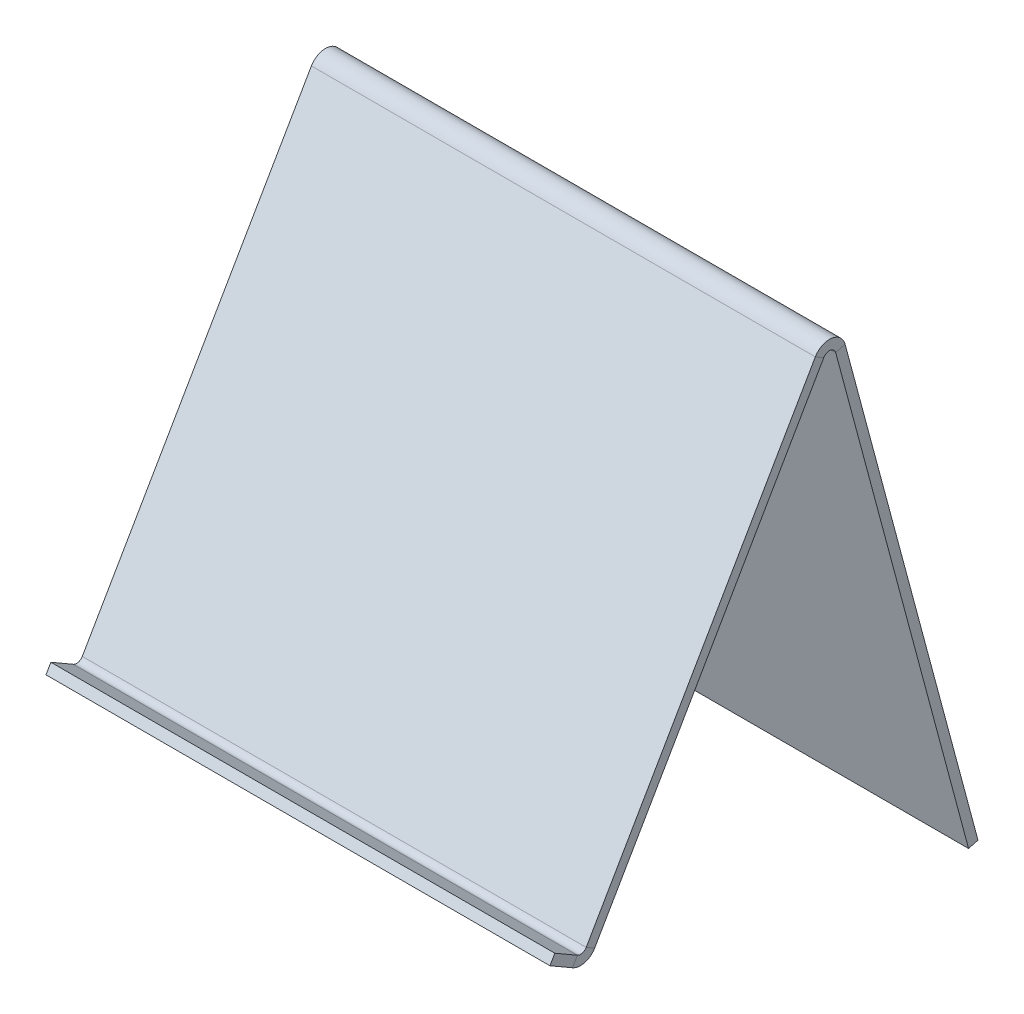
ISO-10303-21;
HEADER;
FILE_DESCRIPTION(('STEP AP214'),'2;1');
FILE_NAME('part.step','',(''),(''),'','','');
FILE_SCHEMA(('AUTOMOTIVE_DESIGN { 1 0 10303 214 1 1 1 1 }'));
ENDSEC;
DATA;
#1=APPLICATION_CONTEXT('core data for automotive mechanical design processes');
#2=APPLICATION_PROTOCOL_DEFINITION('international standard','automotive_design',2000,#1);
#3=PRODUCT_CONTEXT('',#1,'mechanical');
#4=PRODUCT('Part','Part','',(#3));
#5=PRODUCT_RELATED_PRODUCT_CATEGORY('part','',(#4));
#6=PRODUCT_DEFINITION_FORMATION('','',#4);
#7=PRODUCT_DEFINITION_CONTEXT('part definition',#1,'design');
#8=PRODUCT_DEFINITION('design','',#6,#7);
#9=PRODUCT_DEFINITION_SHAPE('','',#8);
#10=(LENGTH_UNIT() NAMED_UNIT(*) SI_UNIT(.MILLI.,.METRE.));
#11=(NAMED_UNIT(*) PLANE_ANGLE_UNIT() SI_UNIT($,.RADIAN.));
#12=(NAMED_UNIT(*) SI_UNIT($,.STERADIAN.) SOLID_ANGLE_UNIT());
#13=UNCERTAINTY_MEASURE_WITH_UNIT(LENGTH_MEASURE(1.E-05),#10,'distance_accuracy_value','');
#14=(GEOMETRIC_REPRESENTATION_CONTEXT(3) GLOBAL_UNCERTAINTY_ASSIGNED_CONTEXT((#13)) GLOBAL_UNIT_ASSIGNED_CONTEXT((#10,
#11,#12)) REPRESENTATION_CONTEXT('',''));
#15=CARTESIAN_POINT('',(0.,0.,0.));
#16=DIRECTION('',(0.,0.,1.));
#17=DIRECTION('',(1.,0.,0.));
#18=AXIS2_PLACEMENT_3D('',#15,#16,#17);
#19=CARTESIAN_POINT('',(155.,-3.26794919243109,-9.66025403784439));
#20=DIRECTION('',(1.,0.,0.));
#21=DIRECTION('',(0.,0.,-1.));
#22=AXIS2_PLACEMENT_3D('',#19,#20,#21);
#23=PLANE('',#22);
#24=DIRECTION('',(0.,-0.499999999999994,-0.866025403784442));
#25=VECTOR('',#24,1.);
#26=CARTESIAN_POINT('',(155.,-3.26794919243109,-9.66025403784439));
#27=LINE('',#26,#25);
#28=CARTESIAN_POINT('',(155.,-3.26794919243109,-9.66025403784439));
#29=VERTEX_POINT('',#28);
#30=CARTESIAN_POINT('',(155.,-4.76794919243107,-12.2583302491977));
#31=VERTEX_POINT('',#30);
#32=EDGE_CURVE('E11',#29,#31,#27,.T.);
#33=ORIENTED_EDGE('',*,*,#32,.F.);
#34=CARTESIAN_POINT('',(155.,-2.2679491924311,-7.92820323027551));
#35=DIRECTION('',(-1.,0.,0.));
#36=DIRECTION('',(0.,0.,1.));
#37=AXIS2_PLACEMENT_3D('',#34,#35,#36);
#38=CIRCLE('',#37,2.);
#39=CARTESIAN_POINT('',(155.,-3.99999999999998,-6.92820323027551));
#40=VERTEX_POINT('',#39);
#41=EDGE_CURVE('E288',#40,#29,#38,.F.);
#42=ORIENTED_EDGE('',*,*,#41,.F.);
#43=DIRECTION('',(0.,0.86602540378444,-0.499999999999997));
#44=VECTOR('',#43,1.);
#45=CARTESIAN_POINT('',(155.,-6.5980762113533,-5.42820323027552));
#46=LINE('',#45,#44);
#47=CARTESIAN_POINT('',(155.,-6.5980762113533,-5.42820323027552));
#48=VERTEX_POINT('',#47);
#49=EDGE_CURVE('E52',#48,#40,#46,.T.);
#50=ORIENTED_EDGE('',*,*,#49,.F.);
#51=CARTESIAN_POINT('',(155.,-2.2679491924311,-7.92820323027551));
#52=DIRECTION('',(1.,0.,0.));
#53=DIRECTION('',(0.,0.,-1.));
#54=AXIS2_PLACEMENT_3D('',#51,#52,#53);
#55=CIRCLE('',#54,5.);
#56=EDGE_CURVE('E153',#48,#31,#55,.T.);
#57=ORIENTED_EDGE('',*,*,#56,.T.);
#58=EDGE_LOOP('',(#33,#42,#50,#57));
#59=FACE_BOUND('',#58,.T.);
#60=ADVANCED_FACE('F43',(#59),#23,.T.);
#61=CARTESIAN_POINT('',(155.,-6.5980762113533,-5.42820323027552));
#62=DIRECTION('',(1.,0.,0.));
#63=DIRECTION('',(0.,0.,-1.));
#64=AXIS2_PLACEMENT_3D('',#61,#62,#63);
#65=PLANE('',#64);
#66=DIRECTION('',(0.,0.866025403784442,-0.499999999999994));
#67=VECTOR('',#66,1.);
#68=CARTESIAN_POINT('',(155.,-4.99999999999998,-8.6602540378444));
#69=LINE('',#68,#67);
#70=CARTESIAN_POINT('',(155.,118.780086210708,-80.1247201319108));
#71=VERTEX_POINT('',#70);
#72=EDGE_CURVE('E147',#29,#71,#69,.T.);
#73=ORIENTED_EDGE('',*,*,#72,.F.);
#74=ORIENTED_EDGE('',*,*,#32,.T.);
#75=DIRECTION('',(0.,0.866025403784442,-0.499999999999994));
#76=VECTOR('',#75,1.);
#77=CARTESIAN_POINT('',(155.,-6.49999999999996,-11.2583302491977));
#78=LINE('',#77,#76);
#79=CARTESIAN_POINT('',(155.,117.280086210708,-82.7227963432642));
#80=VERTEX_POINT('',#79);
#81=EDGE_CURVE('E144',#31,#80,#78,.T.);
#82=ORIENTED_EDGE('',*,*,#81,.T.);
#83=DIRECTION('',(0.,0.500000000000006,0.866025403784435));
#84=VECTOR('',#83,1.);
#85=CARTESIAN_POINT('',(155.,117.280086210708,-82.7227963432642));
#86=LINE('',#85,#84);
#87=EDGE_CURVE('E264',#80,#71,#86,.T.);
#88=ORIENTED_EDGE('',*,*,#87,.T.);
#89=EDGE_LOOP('',(#73,#74,#82,#88));
#90=FACE_BOUND('',#89,.T.);
#91=ADVANCED_FACE('F142',(#90),#65,.T.);
#92=CARTESIAN_POINT('',(0.,-3.99999999999998,-6.92820323027551));
#93=DIRECTION('',(-1.,0.,0.));
#94=DIRECTION('',(0.,0.,1.));
#95=AXIS2_PLACEMENT_3D('',#92,#93,#94);
#96=PLANE('',#95);
#97=DIRECTION('',(0.,-0.86602540378444,0.499999999999997));
#98=VECTOR('',#97,1.);
#99=CARTESIAN_POINT('',(0.,-3.99999999999998,-6.92820323027551));
#100=LINE('',#99,#98);
#101=CARTESIAN_POINT('',(0.,-3.99999999999998,-6.92820323027551));
#102=VERTEX_POINT('',#101);
#103=CARTESIAN_POINT('',(0.,-6.5980762113533,-5.42820323027552));
#104=VERTEX_POINT('',#103);
#105=EDGE_CURVE('E272',#102,#104,#100,.T.);
#106=ORIENTED_EDGE('',*,*,#105,.F.);
#107=CARTESIAN_POINT('',(0.,-2.2679491924311,-7.92820323027551));
#108=DIRECTION('',(-1.,0.,0.));
#109=DIRECTION('',(0.,0.,1.));
#110=AXIS2_PLACEMENT_3D('',#107,#108,#109);
#111=CIRCLE('',#110,2.);
#112=CARTESIAN_POINT('',(0.,-3.26794919243109,-9.66025403784439));
#113=VERTEX_POINT('',#112);
#114=EDGE_CURVE('E201',#102,#113,#111,.F.);
#115=ORIENTED_EDGE('',*,*,#114,.T.);
#116=DIRECTION('',(0.,0.499999999999994,0.866025403784442));
#117=VECTOR('',#116,1.);
#118=CARTESIAN_POINT('',(0.,-4.76794919243107,-12.2583302491977));
#119=LINE('',#118,#117);
#120=CARTESIAN_POINT('',(0.,-4.76794919243107,-12.2583302491977));
#121=VERTEX_POINT('',#120);
#122=EDGE_CURVE('E269',#121,#113,#119,.T.);
#123=ORIENTED_EDGE('',*,*,#122,.F.);
#124=CARTESIAN_POINT('',(0.,-2.2679491924311,-7.92820323027551));
#125=DIRECTION('',(1.,0.,0.));
#126=DIRECTION('',(0.,0.,-1.));
#127=AXIS2_PLACEMENT_3D('',#124,#125,#126);
#128=CIRCLE('',#127,5.);
#129=EDGE_CURVE('E166',#104,#121,#128,.T.);
#130=ORIENTED_EDGE('',*,*,#129,.F.);
#131=EDGE_LOOP('',(#106,#115,#123,#130));
#132=FACE_BOUND('',#131,.T.);
#133=ADVANCED_FACE('F335',(#132),#96,.T.);
#134=CARTESIAN_POINT('',(0.,-4.76794919243107,-12.2583302491977));
#135=DIRECTION('',(-1.,0.,0.));
#136=DIRECTION('',(0.,0.,1.));
#137=AXIS2_PLACEMENT_3D('',#134,#135,#136);
#138=PLANE('',#137);
#139=DIRECTION('',(0.,-0.499999999999998,-0.86602540378444));
#140=VECTOR('',#139,1.);
#141=CARTESIAN_POINT('',(0.,0.,0.));
#142=LINE('',#141,#140);
#143=CARTESIAN_POINT('',(0.,0.,0.));
#144=VERTEX_POINT('',#143);
#145=EDGE_CURVE('E205',#144,#102,#142,.T.);
#146=ORIENTED_EDGE('',*,*,#145,.T.);
#147=ORIENTED_EDGE('',*,*,#105,.T.);
#148=DIRECTION('',(0.,-0.499999999999998,-0.86602540378444));
#149=VECTOR('',#148,1.);
#150=CARTESIAN_POINT('',(0.,-2.59807621135332,1.49999999999999));
#151=LINE('',#150,#149);
#152=CARTESIAN_POINT('',(0.,-2.59807621135332,1.49999999999999));
#153=VERTEX_POINT('',#152);
#154=EDGE_CURVE('E213',#153,#104,#151,.T.);
#155=ORIENTED_EDGE('',*,*,#154,.F.);
#156=DIRECTION('',(0.,0.86602540378444,-0.499999999999998));
#157=VECTOR('',#156,1.);
#158=CARTESIAN_POINT('',(0.,-2.59807621135332,1.49999999999999));
#159=LINE('',#158,#157);
#160=EDGE_CURVE('E209',#153,#144,#159,.T.);
#161=ORIENTED_EDGE('',*,*,#160,.T.);
#162=EDGE_LOOP('',(#146,#147,#155,#161));
#163=FACE_BOUND('',#162,.T.);
#164=ADVANCED_FACE('F338',(#163),#138,.T.);
#165=CARTESIAN_POINT('',(155.,117.574181436221,-89.2844762822783));
#166=DIRECTION('',(1.,0.,0.));
#167=DIRECTION('',(0.,0.,-1.));
#168=AXIS2_PLACEMENT_3D('',#165,#166,#167);
#169=PLANE('',#168);
#170=DIRECTION('',(0.,-0.258819045102526,0.965925826289067));
#171=VECTOR('',#170,1.);
#172=CARTESIAN_POINT('',(155.,117.574181436221,-89.2844762822783));
#173=LINE('',#172,#171);
#174=CARTESIAN_POINT('',(155.,117.574181436221,-89.2844762822783));
#175=VERTEX_POINT('',#174);
#176=CARTESIAN_POINT('',(155.,116.797724300913,-86.3866988034112));
#177=VERTEX_POINT('',#176);
#178=EDGE_CURVE('E60',#175,#177,#173,.T.);
#179=ORIENTED_EDGE('',*,*,#178,.F.);
#180=CARTESIAN_POINT('',(155.,116.280086210708,-84.454847150833));
#181=DIRECTION('',(1.,0.,0.));
#182=DIRECTION('',(0.,0.,-1.));
#183=AXIS2_PLACEMENT_3D('',#180,#181,#182);
#184=CIRCLE('',#183,5.);
#185=EDGE_CURVE('E303',#71,#175,#184,.F.);
#186=ORIENTED_EDGE('',*,*,#185,.F.);
#187=ORIENTED_EDGE('',*,*,#87,.F.);
#188=CARTESIAN_POINT('',(155.,116.280086210708,-84.454847150833));
#189=DIRECTION('',(1.,0.,0.));
#190=DIRECTION('',(0.,0.,-1.));
#191=AXIS2_PLACEMENT_3D('',#188,#189,#190);
#192=CIRCLE('',#191,2.);
#193=EDGE_CURVE('E176',#80,#177,#192,.F.);
#194=ORIENTED_EDGE('',*,*,#193,.T.);
#195=EDGE_LOOP('',(#179,#186,#187,#194));
#196=FACE_BOUND('',#195,.T.);
#197=ADVANCED_FACE('F330',(#196),#169,.T.);
#198=CARTESIAN_POINT('',(155.,117.280086210708,-82.7227963432642));
#199=DIRECTION('',(1.,0.,0.));
#200=DIRECTION('',(0.,0.,-1.));
#201=AXIS2_PLACEMENT_3D('',#198,#199,#200);
#202=PLANE('',#201);
#203=DIRECTION('',(0.,-0.965925826289068,-0.258819045102522));
#204=VECTOR('',#203,1.);
#205=CARTESIAN_POINT('',(155.,129.233937586588,-86.1602540378435));
#206=LINE('',#205,#204);
#207=CARTESIAN_POINT('',(155.,-34.9734528825531,-130.159491705272));
#208=VERTEX_POINT('',#207);
#209=EDGE_CURVE('E307',#175,#208,#206,.T.);
#210=ORIENTED_EDGE('',*,*,#209,.F.);
#211=ORIENTED_EDGE('',*,*,#178,.T.);
#212=DIRECTION('',(0.,-0.965925826289068,-0.258819045102522));
#213=VECTOR('',#212,1.);
#214=CARTESIAN_POINT('',(155.,128.457480451281,-83.2624765589763));
#215=LINE('',#214,#213);
#216=CARTESIAN_POINT('',(155.,-35.7499100178607,-127.261714226405));
#217=VERTEX_POINT('',#216);
#218=EDGE_CURVE('E114',#177,#217,#215,.T.);
#219=ORIENTED_EDGE('',*,*,#218,.T.);
#220=DIRECTION('',(0.,-0.258819045102527,0.965925826289066));
#221=VECTOR('',#220,1.);
#222=CARTESIAN_POINT('',(155.,-34.9734528825531,-130.159491705272));
#223=LINE('',#222,#221);
#224=EDGE_CURVE('E311',#208,#217,#223,.T.);
#225=ORIENTED_EDGE('',*,*,#224,.F.);
#226=EDGE_LOOP('',(#210,#211,#219,#225));
#227=FACE_BOUND('',#226,.T.);
#228=ADVANCED_FACE('F319',(#227),#202,.T.);
#229=CARTESIAN_POINT('',(0.,118.780086210708,-80.1247201319108));
#230=DIRECTION('',(-1.,0.,0.));
#231=DIRECTION('',(0.,0.,1.));
#232=AXIS2_PLACEMENT_3D('',#229,#230,#231);
#233=PLANE('',#232);
#234=DIRECTION('',(0.,-0.500000000000006,-0.866025403784435));
#235=VECTOR('',#234,1.);
#236=CARTESIAN_POINT('',(0.,118.780086210708,-80.1247201319108));
#237=LINE('',#236,#235);
#238=CARTESIAN_POINT('',(0.,118.780086210708,-80.1247201319108));
#239=VERTEX_POINT('',#238);
#240=CARTESIAN_POINT('',(0.,117.280086210708,-82.7227963432642));
#241=VERTEX_POINT('',#240);
#242=EDGE_CURVE('E101',#239,#241,#237,.T.);
#243=ORIENTED_EDGE('',*,*,#242,.F.);
#244=CARTESIAN_POINT('',(0.,116.280086210708,-84.454847150833));
#245=DIRECTION('',(1.,0.,0.));
#246=DIRECTION('',(0.,0.,-1.));
#247=AXIS2_PLACEMENT_3D('',#244,#245,#246);
#248=CIRCLE('',#247,5.);
#249=CARTESIAN_POINT('',(0.,117.574181436221,-89.2844762822783));
#250=VERTEX_POINT('',#249);
#251=EDGE_CURVE('E195',#239,#250,#248,.F.);
#252=ORIENTED_EDGE('',*,*,#251,.T.);
#253=DIRECTION('',(0.,0.258819045102526,-0.965925826289067));
#254=VECTOR('',#253,1.);
#255=CARTESIAN_POINT('',(0.,116.797724300913,-86.3866988034112));
#256=LINE('',#255,#254);
#257=CARTESIAN_POINT('',(0.,116.797724300913,-86.3866988034112));
#258=VERTEX_POINT('',#257);
#259=EDGE_CURVE('E108',#258,#250,#256,.T.);
#260=ORIENTED_EDGE('',*,*,#259,.F.);
#261=CARTESIAN_POINT('',(0.,116.280086210708,-84.454847150833));
#262=DIRECTION('',(1.,0.,0.));
#263=DIRECTION('',(0.,0.,-1.));
#264=AXIS2_PLACEMENT_3D('',#261,#262,#263);
#265=CIRCLE('',#264,2.);
#266=EDGE_CURVE('E222',#241,#258,#265,.F.);
#267=ORIENTED_EDGE('',*,*,#266,.F.);
#268=EDGE_LOOP('',(#243,#252,#260,#267));
#269=FACE_BOUND('',#268,.T.);
#270=ADVANCED_FACE('F367',(#269),#233,.T.);
#271=CARTESIAN_POINT('',(0.,116.797724300913,-86.3866988034112));
#272=DIRECTION('',(-1.,0.,0.));
#273=DIRECTION('',(0.,0.,1.));
#274=AXIS2_PLACEMENT_3D('',#271,#272,#273);
#275=PLANE('',#274);
#276=DIRECTION('',(0.,0.866025403784442,-0.499999999999994));
#277=VECTOR('',#276,1.);
#278=CARTESIAN_POINT('',(0.,-4.99999999999998,-8.6602540378444));
#279=LINE('',#278,#277);
#280=EDGE_CURVE('E198',#113,#239,#279,.T.);
#281=ORIENTED_EDGE('',*,*,#280,.T.);
#282=ORIENTED_EDGE('',*,*,#242,.T.);
#283=DIRECTION('',(0.,0.866025403784442,-0.499999999999994));
#284=VECTOR('',#283,1.);
#285=CARTESIAN_POINT('',(0.,-6.49999999999996,-11.2583302491977));
#286=LINE('',#285,#284);
#287=EDGE_CURVE('E219',#121,#241,#286,.T.);
#288=ORIENTED_EDGE('',*,*,#287,.F.);
#289=ORIENTED_EDGE('',*,*,#122,.T.);
#290=EDGE_LOOP('',(#281,#282,#288,#289));
#291=FACE_BOUND('',#290,.T.);
#292=ADVANCED_FACE('F370',(#291),#275,.T.);
#293=CARTESIAN_POINT('',(155.,128.457480451281,-83.2624765589763));
#294=DIRECTION('',(0.,0.258819045102522,-0.965925826289068));
#295=DIRECTION('',(0.,0.965925826289068,0.258819045102522));
#296=AXIS2_PLACEMENT_3D('',#293,#294,#295);
#297=PLANE('',#296);
#298=DIRECTION('',(0.,-0.965925826289068,-0.258819045102522));
#299=VECTOR('',#298,1.);
#300=CARTESIAN_POINT('',(0.,128.457480451281,-83.2624765589763));
#301=LINE('',#300,#299);
#302=CARTESIAN_POINT('',(0.,-35.7499100178607,-127.261714226405));
#303=VERTEX_POINT('',#302);
#304=EDGE_CURVE('E183',#258,#303,#301,.T.);
#305=ORIENTED_EDGE('',*,*,#304,.T.);
#306=DIRECTION('',(-1.,0.,0.));
#307=VECTOR('',#306,1.);
#308=CARTESIAN_POINT('',(155.,-35.7499100178607,-127.261714226405));
#309=LINE('',#308,#307);
#310=EDGE_CURVE('E257',#217,#303,#309,.T.);
#311=ORIENTED_EDGE('',*,*,#310,.F.);
#312=ORIENTED_EDGE('',*,*,#218,.F.);
#313=DIRECTION('',(-1.,0.,0.));
#314=VECTOR('',#313,1.);
#315=CARTESIAN_POINT('',(155.,116.797724300913,-86.3866988034112));
#316=LINE('',#315,#314);
#317=EDGE_CURVE('E179',#177,#258,#316,.T.);
#318=ORIENTED_EDGE('',*,*,#317,.T.);
#319=EDGE_LOOP('',(#305,#311,#312,#318));
#320=FACE_BOUND('',#319,.T.);
#321=ADVANCED_FACE('F373',(#320),#297,.F.);
#322=CARTESIAN_POINT('',(155.,-34.9734528825531,-130.159491705272));
#323=DIRECTION('',(0.,-0.965925826289067,-0.258819045102527));
#324=DIRECTION('',(0.,0.258819045102527,-0.965925826289067));
#325=AXIS2_PLACEMENT_3D('',#322,#323,#324);
#326=PLANE('',#325);
#327=DIRECTION('',(0.,-0.258819045102527,0.965925826289066));
#328=VECTOR('',#327,1.);
#329=CARTESIAN_POINT('',(0.,-34.9734528825531,-130.159491705272));
#330=LINE('',#329,#328);
#331=CARTESIAN_POINT('',(0.,-34.9734528825531,-130.159491705272));
#332=VERTEX_POINT('',#331);
#333=EDGE_CURVE('E187',#332,#303,#330,.T.);
#334=ORIENTED_EDGE('',*,*,#333,.F.);
#335=DIRECTION('',(-1.,0.,0.));
#336=VECTOR('',#335,1.);
#337=CARTESIAN_POINT('',(155.,-34.9734528825531,-130.159491705272));
#338=LINE('',#337,#336);
#339=EDGE_CURVE('E254',#208,#332,#338,.T.);
#340=ORIENTED_EDGE('',*,*,#339,.F.);
#341=ORIENTED_EDGE('',*,*,#224,.T.);
#342=ORIENTED_EDGE('',*,*,#310,.T.);
#343=EDGE_LOOP('',(#334,#340,#341,#342));
#344=FACE_BOUND('',#343,.T.);
#345=ADVANCED_FACE('F318',(#344),#326,.T.);
#346=CARTESIAN_POINT('',(155.,129.233937586588,-86.1602540378435));
#347=DIRECTION('',(0.,0.258819045102522,-0.965925826289068));
#348=DIRECTION('',(0.,0.965925826289068,0.258819045102522));
#349=AXIS2_PLACEMENT_3D('',#346,#347,#348);
#350=PLANE('',#349);
#351=DIRECTION('',(0.,-0.965925826289068,-0.258819045102522));
#352=VECTOR('',#351,1.);
#353=CARTESIAN_POINT('',(0.,129.233937586588,-86.1602540378435));
#354=LINE('',#353,#352);
#355=EDGE_CURVE('E191',#250,#332,#354,.T.);
#356=ORIENTED_EDGE('',*,*,#355,.F.);
#357=DIRECTION('',(-1.,0.,0.));
#358=VECTOR('',#357,1.);
#359=CARTESIAN_POINT('',(155.,117.574181436221,-89.2844762822783));
#360=LINE('',#359,#358);
#361=EDGE_CURVE('E250',#175,#250,#360,.T.);
#362=ORIENTED_EDGE('',*,*,#361,.F.);
#363=ORIENTED_EDGE('',*,*,#209,.T.);
#364=ORIENTED_EDGE('',*,*,#339,.T.);
#365=EDGE_LOOP('',(#356,#362,#363,#364));
#366=FACE_BOUND('',#365,.T.);
#367=ADVANCED_FACE('F323',(#366),#350,.T.);
#368=CARTESIAN_POINT('',(155.,116.280086210708,-84.454847150833));
#369=DIRECTION('',(-1.,0.,0.));
#370=DIRECTION('',(0.,0.,1.));
#371=AXIS2_PLACEMENT_3D('',#368,#369,#370);
#372=CYLINDRICAL_SURFACE('',#371,5.);
#373=ORIENTED_EDGE('',*,*,#251,.F.);
#374=DIRECTION('',(-1.,0.,0.));
#375=VECTOR('',#374,1.);
#376=CARTESIAN_POINT('',(155.,118.780086210708,-80.1247201319108));
#377=LINE('',#376,#375);
#378=EDGE_CURVE('E246',#71,#239,#377,.T.);
#379=ORIENTED_EDGE('',*,*,#378,.F.);
#380=ORIENTED_EDGE('',*,*,#185,.T.);
#381=ORIENTED_EDGE('',*,*,#361,.T.);
#382=EDGE_LOOP('',(#373,#379,#380,#381));
#383=FACE_BOUND('',#382,.T.);
#384=ADVANCED_FACE('F326',(#383),#372,.T.);
#385=CARTESIAN_POINT('',(155.,-4.99999999999998,-8.6602540378444));
#386=DIRECTION('',(0.,0.499999999999995,0.866025403784442));
#387=DIRECTION('',(0.,-0.866025403784442,0.499999999999994));
#388=AXIS2_PLACEMENT_3D('',#385,#386,#387);
#389=PLANE('',#388);
#390=ORIENTED_EDGE('',*,*,#280,.F.);
#391=DIRECTION('',(-1.,0.,0.));
#392=VECTOR('',#391,1.);
#393=CARTESIAN_POINT('',(155.,-3.26794919243109,-9.66025403784439));
#394=LINE('',#393,#392);
#395=EDGE_CURVE('E242',#29,#113,#394,.T.);
#396=ORIENTED_EDGE('',*,*,#395,.F.);
#397=ORIENTED_EDGE('',*,*,#72,.T.);
#398=ORIENTED_EDGE('',*,*,#378,.T.);
#399=EDGE_LOOP('',(#390,#396,#397,#398));
#400=FACE_BOUND('',#399,.T.);
#401=ADVANCED_FACE('F333',(#400),#389,.T.);
#402=CARTESIAN_POINT('',(155.,-2.2679491924311,-7.92820323027551));
#403=DIRECTION('',(-1.,0.,0.));
#404=DIRECTION('',(0.,0.,1.));
#405=AXIS2_PLACEMENT_3D('',#402,#403,#404);
#406=CYLINDRICAL_SURFACE('',#405,2.);
#407=ORIENTED_EDGE('',*,*,#114,.F.);
#408=DIRECTION('',(-1.,0.,0.));
#409=VECTOR('',#408,1.);
#410=CARTESIAN_POINT('',(155.,-3.99999999999998,-6.92820323027551));
#411=LINE('',#410,#409);
#412=EDGE_CURVE('E238',#40,#102,#411,.T.);
#413=ORIENTED_EDGE('',*,*,#412,.F.);
#414=ORIENTED_EDGE('',*,*,#41,.T.);
#415=ORIENTED_EDGE('',*,*,#395,.T.);
#416=EDGE_LOOP('',(#407,#413,#414,#415));
#417=FACE_BOUND('',#416,.T.);
#418=ADVANCED_FACE('F287',(#417),#406,.F.);
#419=CARTESIAN_POINT('',(155.,0.,0.));
#420=DIRECTION('',(0.,0.86602540378444,-0.499999999999998));
#421=DIRECTION('',(0.,0.499999999999998,0.86602540378444));
#422=AXIS2_PLACEMENT_3D('',#419,#420,#421);
#423=PLANE('',#422);
#424=ORIENTED_EDGE('',*,*,#145,.F.);
#425=DIRECTION('',(-1.,0.,0.));
#426=VECTOR('',#425,1.);
#427=CARTESIAN_POINT('',(155.,0.,0.));
#428=LINE('',#427,#426);
#429=CARTESIAN_POINT('',(155.,0.,0.));
#430=VERTEX_POINT('',#429);
#431=EDGE_CURVE('E235',#430,#144,#428,.T.);
#432=ORIENTED_EDGE('',*,*,#431,.F.);
#433=DIRECTION('',(0.,-0.499999999999998,-0.86602540378444));
#434=VECTOR('',#433,1.);
#435=CARTESIAN_POINT('',(155.,0.,0.));
#436=LINE('',#435,#434);
#437=EDGE_CURVE('E281',#430,#40,#436,.T.);
#438=ORIENTED_EDGE('',*,*,#437,.T.);
#439=ORIENTED_EDGE('',*,*,#412,.T.);
#440=EDGE_LOOP('',(#424,#432,#438,#439));
#441=FACE_BOUND('',#440,.T.);
#442=ADVANCED_FACE('F293',(#441),#423,.T.);
#443=CARTESIAN_POINT('',(155.,-2.59807621135332,1.49999999999999));
#444=DIRECTION('',(0.,0.499999999999998,0.86602540378444));
#445=DIRECTION('',(0.,-0.86602540378444,0.499999999999998));
#446=AXIS2_PLACEMENT_3D('',#443,#444,#445);
#447=PLANE('',#446);
#448=ORIENTED_EDGE('',*,*,#160,.F.);
#449=DIRECTION('',(-1.,0.,0.));
#450=VECTOR('',#449,1.);
#451=CARTESIAN_POINT('',(155.,-2.59807621135332,1.49999999999999));
#452=LINE('',#451,#450);
#453=CARTESIAN_POINT('',(155.,-2.59807621135332,1.49999999999999));
#454=VERTEX_POINT('',#453);
#455=EDGE_CURVE('E232',#454,#153,#452,.T.);
#456=ORIENTED_EDGE('',*,*,#455,.F.);
#457=DIRECTION('',(0.,0.86602540378444,-0.499999999999998));
#458=VECTOR('',#457,1.);
#459=CARTESIAN_POINT('',(155.,-2.59807621135332,1.49999999999999));
#460=LINE('',#459,#458);
#461=EDGE_CURVE('E295',#454,#430,#460,.T.);
#462=ORIENTED_EDGE('',*,*,#461,.T.);
#463=ORIENTED_EDGE('',*,*,#431,.T.);
#464=EDGE_LOOP('',(#448,#456,#462,#463));
#465=FACE_BOUND('',#464,.T.);
#466=ADVANCED_FACE('F343',(#465),#447,.T.);
#467=CARTESIAN_POINT('',(155.,-2.59807621135332,1.49999999999999));
#468=DIRECTION('',(0.,0.86602540378444,-0.499999999999998));
#469=DIRECTION('',(0.,0.499999999999998,0.86602540378444));
#470=AXIS2_PLACEMENT_3D('',#467,#468,#469);
#471=PLANE('',#470);
#472=ORIENTED_EDGE('',*,*,#154,.T.);
#473=DIRECTION('',(-1.,0.,0.));
#474=VECTOR('',#473,1.);
#475=CARTESIAN_POINT('',(155.,-6.5980762113533,-5.42820323027552));
#476=LINE('',#475,#474);
#477=EDGE_CURVE('E169',#48,#104,#476,.T.);
#478=ORIENTED_EDGE('',*,*,#477,.F.);
#479=DIRECTION('',(0.,-0.499999999999998,-0.86602540378444));
#480=VECTOR('',#479,1.);
#481=CARTESIAN_POINT('',(155.,-2.59807621135332,1.49999999999999));
#482=LINE('',#481,#480);
#483=EDGE_CURVE('E159',#454,#48,#482,.T.);
#484=ORIENTED_EDGE('',*,*,#483,.F.);
#485=ORIENTED_EDGE('',*,*,#455,.T.);
#486=EDGE_LOOP('',(#472,#478,#484,#485));
#487=FACE_BOUND('',#486,.T.);
#488=ADVANCED_FACE('F341',(#487),#471,.F.);
#489=CARTESIAN_POINT('',(155.,-2.2679491924311,-7.92820323027551));
#490=DIRECTION('',(-1.,0.,0.));
#491=DIRECTION('',(0.,0.,1.));
#492=AXIS2_PLACEMENT_3D('',#489,#490,#491);
#493=CYLINDRICAL_SURFACE('',#492,5.);
#494=ORIENTED_EDGE('',*,*,#129,.T.);
#495=DIRECTION('',(-1.,0.,0.));
#496=VECTOR('',#495,1.);
#497=CARTESIAN_POINT('',(155.,-4.76794919243107,-12.2583302491977));
#498=LINE('',#497,#496);
#499=EDGE_CURVE('E163',#31,#121,#498,.T.);
#500=ORIENTED_EDGE('',*,*,#499,.F.);
#501=ORIENTED_EDGE('',*,*,#56,.F.);
#502=ORIENTED_EDGE('',*,*,#477,.T.);
#503=EDGE_LOOP('',(#494,#500,#501,#502));
#504=FACE_BOUND('',#503,.T.);
#505=ADVANCED_FACE('F164',(#504),#493,.T.);
#506=CARTESIAN_POINT('',(155.,-6.49999999999996,-11.2583302491977));
#507=DIRECTION('',(0.,0.499999999999995,0.866025403784442));
#508=DIRECTION('',(0.,-0.866025403784442,0.499999999999994));
#509=AXIS2_PLACEMENT_3D('',#506,#507,#508);
#510=PLANE('',#509);
#511=ORIENTED_EDGE('',*,*,#287,.T.);
#512=DIRECTION('',(-1.,0.,0.));
#513=VECTOR('',#512,1.);
#514=CARTESIAN_POINT('',(155.,117.280086210708,-82.7227963432642));
#515=LINE('',#514,#513);
#516=EDGE_CURVE('E170',#80,#241,#515,.T.);
#517=ORIENTED_EDGE('',*,*,#516,.F.);
#518=ORIENTED_EDGE('',*,*,#81,.F.);
#519=ORIENTED_EDGE('',*,*,#499,.T.);
#520=EDGE_LOOP('',(#511,#517,#518,#519));
#521=FACE_BOUND('',#520,.T.);
#522=ADVANCED_FACE('F172',(#521),#510,.F.);
#523=CARTESIAN_POINT('',(155.,116.280086210708,-84.454847150833));
#524=DIRECTION('',(-1.,0.,0.));
#525=DIRECTION('',(0.,0.,1.));
#526=AXIS2_PLACEMENT_3D('',#523,#524,#525);
#527=CYLINDRICAL_SURFACE('',#526,2.);
#528=ORIENTED_EDGE('',*,*,#266,.T.);
#529=ORIENTED_EDGE('',*,*,#317,.F.);
#530=ORIENTED_EDGE('',*,*,#193,.F.);
#531=ORIENTED_EDGE('',*,*,#516,.T.);
#532=EDGE_LOOP('',(#528,#529,#530,#531));
#533=FACE_BOUND('',#532,.T.);
#534=ADVANCED_FACE('F425',(#533),#527,.F.);
#535=CARTESIAN_POINT('',(155.,116.280086210708,-84.454847150833));
#536=DIRECTION('',(1.,0.,0.));
#537=DIRECTION('',(0.,0.,-1.));
#538=AXIS2_PLACEMENT_3D('',#535,#536,#537);
#539=PLANE('',#538);
#540=ORIENTED_EDGE('',*,*,#483,.T.);
#541=ORIENTED_EDGE('',*,*,#49,.T.);
#542=ORIENTED_EDGE('',*,*,#437,.F.);
#543=ORIENTED_EDGE('',*,*,#461,.F.);
#544=EDGE_LOOP('',(#540,#541,#542,#543));
#545=FACE_BOUND('',#544,.T.);
#546=ADVANCED_FACE('F278',(#545),#539,.T.);
#547=CARTESIAN_POINT('',(0.,116.280086210708,-84.454847150833));
#548=DIRECTION('',(1.,0.,0.));
#549=DIRECTION('',(0.,0.,-1.));
#550=AXIS2_PLACEMENT_3D('',#547,#548,#549);
#551=PLANE('',#550);
#552=ORIENTED_EDGE('',*,*,#304,.F.);
#553=ORIENTED_EDGE('',*,*,#259,.T.);
#554=ORIENTED_EDGE('',*,*,#355,.T.);
#555=ORIENTED_EDGE('',*,*,#333,.T.);
#556=EDGE_LOOP('',(#552,#553,#554,#555));
#557=FACE_BOUND('',#556,.T.);
#558=ADVANCED_FACE('F445',(#557),#551,.F.);
#559=CLOSED_SHELL('',(#60,#91,#133,#164,#197,#228,#270,#292,#321,#345,#367,#384,#401,#418,#442,
#466,#488,#505,#522,#534,#546,#558));
#560=MANIFOLD_SOLID_BREP('B2',#559);
#561=ADVANCED_BREP_SHAPE_REPRESENTATION('',(#18,#560),#14);
#562=SHAPE_DEFINITION_REPRESENTATION(#9,#561);
ENDSEC;
END-ISO-10303-21;
